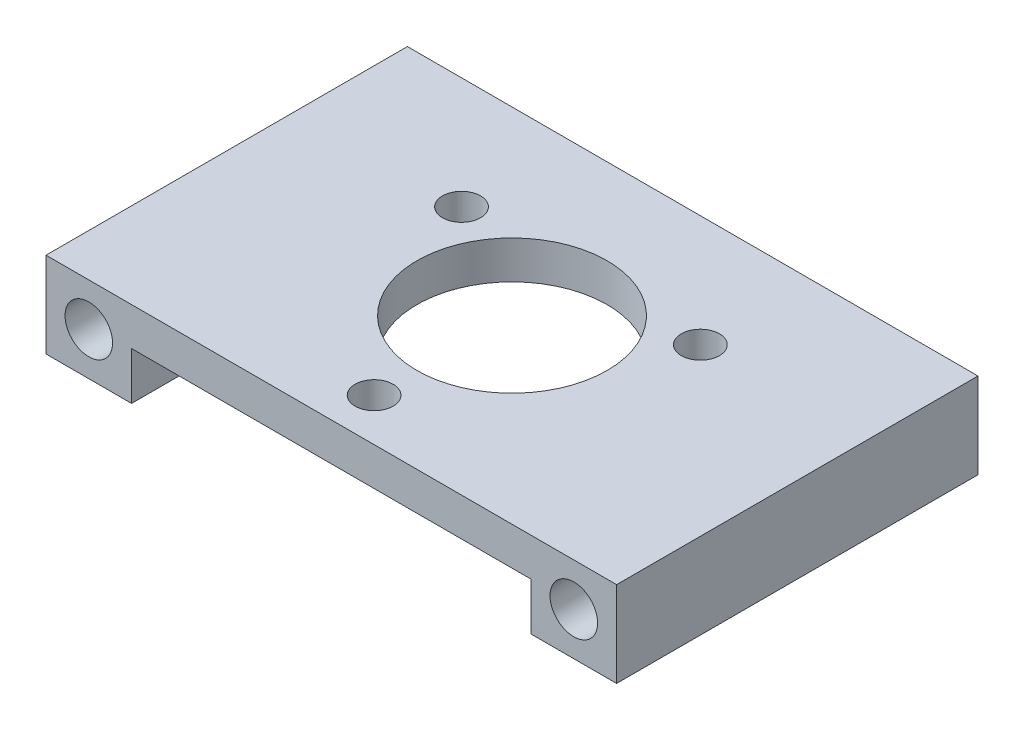
ISO-10303-21;
HEADER;
FILE_DESCRIPTION(('STEP AP214'),'2;1');
FILE_NAME('part.step','',(''),(''),'','','');
FILE_SCHEMA(('AUTOMOTIVE_DESIGN { 1 0 10303 214 1 1 1 1 }'));
ENDSEC;
DATA;
#1=APPLICATION_CONTEXT('core data for automotive mechanical design processes');
#2=APPLICATION_PROTOCOL_DEFINITION('international standard','automotive_design',2000,#1);
#3=PRODUCT_CONTEXT('',#1,'mechanical');
#4=PRODUCT('Part','Part','',(#3));
#5=PRODUCT_RELATED_PRODUCT_CATEGORY('part','',(#4));
#6=PRODUCT_DEFINITION_FORMATION('','',#4);
#7=PRODUCT_DEFINITION_CONTEXT('part definition',#1,'design');
#8=PRODUCT_DEFINITION('design','',#6,#7);
#9=PRODUCT_DEFINITION_SHAPE('','',#8);
#10=(LENGTH_UNIT() NAMED_UNIT(*) SI_UNIT(.MILLI.,.METRE.));
#11=(NAMED_UNIT(*) PLANE_ANGLE_UNIT() SI_UNIT($,.RADIAN.));
#12=(NAMED_UNIT(*) SI_UNIT($,.STERADIAN.) SOLID_ANGLE_UNIT());
#13=UNCERTAINTY_MEASURE_WITH_UNIT(LENGTH_MEASURE(1.E-05),#10,'distance_accuracy_value','');
#14=(GEOMETRIC_REPRESENTATION_CONTEXT(3) GLOBAL_UNCERTAINTY_ASSIGNED_CONTEXT((#13)) GLOBAL_UNIT_ASSIGNED_CONTEXT((#10,
#11,#12)) REPRESENTATION_CONTEXT('',''));
#15=CARTESIAN_POINT('',(0.,0.,0.));
#16=DIRECTION('',(0.,0.,1.));
#17=DIRECTION('',(1.,0.,0.));
#18=AXIS2_PLACEMENT_3D('',#15,#16,#17);
#19=CARTESIAN_POINT('',(0.,0.,38.));
#20=DIRECTION('',(0.,0.,-1.));
#21=DIRECTION('',(-1.,0.,0.));
#22=AXIS2_PLACEMENT_3D('',#19,#20,#21);
#23=PLANE('',#22);
#24=DIRECTION('',(-1.,0.,0.));
#25=VECTOR('',#24,1.);
#26=CARTESIAN_POINT('',(-30.,0.,38.));
#27=LINE('',#26,#25);
#28=CARTESIAN_POINT('',(30.,0.,38.));
#29=VERTEX_POINT('',#28);
#30=CARTESIAN_POINT('',(-30.,0.,38.));
#31=VERTEX_POINT('',#30);
#32=EDGE_CURVE('E144',#29,#31,#27,.T.);
#33=ORIENTED_EDGE('',*,*,#32,.T.);
#34=DIRECTION('',(0.,-1.,0.));
#35=VECTOR('',#34,1.);
#36=CARTESIAN_POINT('',(-30.,0.,38.));
#37=LINE('',#36,#35);
#38=CARTESIAN_POINT('',(-30.,-9.00000000000001,38.));
#39=VERTEX_POINT('',#38);
#40=EDGE_CURVE('E92',#31,#39,#37,.T.);
#41=ORIENTED_EDGE('',*,*,#40,.T.);
#42=DIRECTION('',(1.,0.,0.));
#43=VECTOR('',#42,1.);
#44=CARTESIAN_POINT('',(-30.,-9.00000000000001,38.));
#45=LINE('',#44,#43);
#46=CARTESIAN_POINT('',(-21.,-9.00000000000001,38.));
#47=VERTEX_POINT('',#46);
#48=EDGE_CURVE('E159',#39,#47,#45,.T.);
#49=ORIENTED_EDGE('',*,*,#48,.T.);
#50=DIRECTION('',(0.,1.,0.));
#51=VECTOR('',#50,1.);
#52=CARTESIAN_POINT('',(-21.,-9.00000000000001,38.));
#53=LINE('',#52,#51);
#54=CARTESIAN_POINT('',(-21.,-4.,38.));
#55=VERTEX_POINT('',#54);
#56=EDGE_CURVE('E172',#47,#55,#53,.T.);
#57=ORIENTED_EDGE('',*,*,#56,.T.);
#58=DIRECTION('',(1.,0.,0.));
#59=VECTOR('',#58,1.);
#60=CARTESIAN_POINT('',(-21.,-4.,38.));
#61=LINE('',#60,#59);
#62=CARTESIAN_POINT('',(21.,-4.,38.));
#63=VERTEX_POINT('',#62);
#64=EDGE_CURVE('E111',#55,#63,#61,.T.);
#65=ORIENTED_EDGE('',*,*,#64,.T.);
#66=DIRECTION('',(0.,-1.,0.));
#67=VECTOR('',#66,1.);
#68=CARTESIAN_POINT('',(21.,-9.,38.));
#69=LINE('',#68,#67);
#70=CARTESIAN_POINT('',(21.,-9.,38.));
#71=VERTEX_POINT('',#70);
#72=EDGE_CURVE('E105',#63,#71,#69,.T.);
#73=ORIENTED_EDGE('',*,*,#72,.T.);
#74=DIRECTION('',(1.,0.,0.));
#75=VECTOR('',#74,1.);
#76=CARTESIAN_POINT('',(30.,-9.,38.));
#77=LINE('',#76,#75);
#78=CARTESIAN_POINT('',(30.,-9.,38.));
#79=VERTEX_POINT('',#78);
#80=EDGE_CURVE('E109',#71,#79,#77,.T.);
#81=ORIENTED_EDGE('',*,*,#80,.T.);
#82=DIRECTION('',(0.,1.,0.));
#83=VECTOR('',#82,1.);
#84=CARTESIAN_POINT('',(30.,0.,38.));
#85=LINE('',#84,#83);
#86=EDGE_CURVE('E49',#79,#29,#85,.T.);
#87=ORIENTED_EDGE('',*,*,#86,.T.);
#88=EDGE_LOOP('',(#33,#41,#49,#57,#65,#73,#81,#87));
#89=FACE_BOUND('',#88,.T.);
#90=CARTESIAN_POINT('',(25.5,-4.5,38.));
#91=DIRECTION('',(0.,0.,1.));
#92=DIRECTION('',(-1.,0.,0.));
#93=AXIS2_PLACEMENT_3D('',#90,#91,#92);
#94=CIRCLE('',#93,2.5);
#95=CARTESIAN_POINT('',(23.,-4.5,38.));
#96=VERTEX_POINT('',#95);
#97=EDGE_CURVE('E133',#96,#96,#94,.T.);
#98=ORIENTED_EDGE('',*,*,#97,.F.);
#99=EDGE_LOOP('',(#98));
#100=FACE_BOUND('',#99,.T.);
#101=CARTESIAN_POINT('',(-25.5,-4.5,38.));
#102=DIRECTION('',(0.,0.,1.));
#103=DIRECTION('',(1.,0.,0.));
#104=AXIS2_PLACEMENT_3D('',#101,#102,#103);
#105=CIRCLE('',#104,2.5);
#106=CARTESIAN_POINT('',(-23.,-4.5,38.));
#107=VERTEX_POINT('',#106);
#108=EDGE_CURVE('E181',#107,#107,#105,.T.);
#109=ORIENTED_EDGE('',*,*,#108,.F.);
#110=EDGE_LOOP('',(#109));
#111=FACE_BOUND('',#110,.T.);
#112=ADVANCED_FACE('F32',(#89,#100,#111),#23,.F.);
#113=CARTESIAN_POINT('',(0.,0.,0.));
#114=DIRECTION('',(0.,0.,-1.));
#115=DIRECTION('',(-1.,0.,0.));
#116=AXIS2_PLACEMENT_3D('',#113,#114,#115);
#117=PLANE('',#116);
#118=CARTESIAN_POINT('',(25.5,-4.5,0.));
#119=DIRECTION('',(0.,0.,1.));
#120=DIRECTION('',(-1.,0.,0.));
#121=AXIS2_PLACEMENT_3D('',#118,#119,#120);
#122=CIRCLE('',#121,2.5);
#123=CARTESIAN_POINT('',(23.,-4.5,0.));
#124=VERTEX_POINT('',#123);
#125=EDGE_CURVE('E178',#124,#124,#122,.T.);
#126=ORIENTED_EDGE('',*,*,#125,.T.);
#127=EDGE_LOOP('',(#126));
#128=FACE_BOUND('',#127,.T.);
#129=DIRECTION('',(-1.,0.,0.));
#130=VECTOR('',#129,1.);
#131=CARTESIAN_POINT('',(-30.,0.,0.));
#132=LINE('',#131,#130);
#133=CARTESIAN_POINT('',(30.,0.,0.));
#134=VERTEX_POINT('',#133);
#135=CARTESIAN_POINT('',(-30.,0.,0.));
#136=VERTEX_POINT('',#135);
#137=EDGE_CURVE('E129',#134,#136,#132,.T.);
#138=ORIENTED_EDGE('',*,*,#137,.F.);
#139=DIRECTION('',(0.,1.,0.));
#140=VECTOR('',#139,1.);
#141=CARTESIAN_POINT('',(30.,0.,0.));
#142=LINE('',#141,#140);
#143=CARTESIAN_POINT('',(30.,-9.,0.));
#144=VERTEX_POINT('',#143);
#145=EDGE_CURVE('E84',#144,#134,#142,.T.);
#146=ORIENTED_EDGE('',*,*,#145,.F.);
#147=DIRECTION('',(1.,0.,0.));
#148=VECTOR('',#147,1.);
#149=CARTESIAN_POINT('',(30.,-9.,0.));
#150=LINE('',#149,#148);
#151=CARTESIAN_POINT('',(21.,-9.,0.));
#152=VERTEX_POINT('',#151);
#153=EDGE_CURVE('E78',#152,#144,#150,.T.);
#154=ORIENTED_EDGE('',*,*,#153,.F.);
#155=DIRECTION('',(0.,-1.,0.));
#156=VECTOR('',#155,1.);
#157=CARTESIAN_POINT('',(21.,-9.,0.));
#158=LINE('',#157,#156);
#159=CARTESIAN_POINT('',(21.,-4.,0.));
#160=VERTEX_POINT('',#159);
#161=EDGE_CURVE('E119',#160,#152,#158,.T.);
#162=ORIENTED_EDGE('',*,*,#161,.F.);
#163=DIRECTION('',(1.,0.,0.));
#164=VECTOR('',#163,1.);
#165=CARTESIAN_POINT('',(-21.,-4.,0.));
#166=LINE('',#165,#164);
#167=CARTESIAN_POINT('',(-21.,-4.,0.));
#168=VERTEX_POINT('',#167);
#169=EDGE_CURVE('E139',#168,#160,#166,.T.);
#170=ORIENTED_EDGE('',*,*,#169,.F.);
#171=DIRECTION('',(0.,1.,0.));
#172=VECTOR('',#171,1.);
#173=CARTESIAN_POINT('',(-21.,-9.00000000000001,0.));
#174=LINE('',#173,#172);
#175=CARTESIAN_POINT('',(-21.,-9.00000000000001,0.));
#176=VERTEX_POINT('',#175);
#177=EDGE_CURVE('E137',#176,#168,#174,.T.);
#178=ORIENTED_EDGE('',*,*,#177,.F.);
#179=DIRECTION('',(1.,0.,0.));
#180=VECTOR('',#179,1.);
#181=CARTESIAN_POINT('',(-30.,-9.00000000000001,0.));
#182=LINE('',#181,#180);
#183=CARTESIAN_POINT('',(-30.,-9.00000000000001,0.));
#184=VERTEX_POINT('',#183);
#185=EDGE_CURVE('E135',#184,#176,#182,.T.);
#186=ORIENTED_EDGE('',*,*,#185,.F.);
#187=DIRECTION('',(0.,-1.,0.));
#188=VECTOR('',#187,1.);
#189=CARTESIAN_POINT('',(-30.,0.,0.));
#190=LINE('',#189,#188);
#191=EDGE_CURVE('E132',#136,#184,#190,.T.);
#192=ORIENTED_EDGE('',*,*,#191,.F.);
#193=EDGE_LOOP('',(#138,#146,#154,#162,#170,#178,#186,#192));
#194=FACE_BOUND('',#193,.T.);
#195=CARTESIAN_POINT('',(-25.5,-4.5,0.));
#196=DIRECTION('',(0.,0.,1.));
#197=DIRECTION('',(1.,0.,0.));
#198=AXIS2_PLACEMENT_3D('',#195,#196,#197);
#199=CIRCLE('',#198,2.5);
#200=CARTESIAN_POINT('',(-23.,-4.5,0.));
#201=VERTEX_POINT('',#200);
#202=EDGE_CURVE('E184',#201,#201,#199,.T.);
#203=ORIENTED_EDGE('',*,*,#202,.T.);
#204=EDGE_LOOP('',(#203));
#205=FACE_BOUND('',#204,.T.);
#206=ADVANCED_FACE('F163',(#128,#194,#205),#117,.T.);
#207=CARTESIAN_POINT('',(-30.,0.,38.));
#208=DIRECTION('',(0.,-1.,0.));
#209=DIRECTION('',(1.,0.,0.));
#210=AXIS2_PLACEMENT_3D('',#207,#208,#209);
#211=PLANE('',#210);
#212=CARTESIAN_POINT('',(-12.5573683548735,0.,11.7499999999996));
#213=DIRECTION('',(0.,-1.,0.));
#214=DIRECTION('',(1.,0.,0.));
#215=AXIS2_PLACEMENT_3D('',#212,#213,#214);
#216=CIRCLE('',#215,2.);
#217=CARTESIAN_POINT('',(-10.5573683548735,0.,11.7499999999996));
#218=VERTEX_POINT('',#217);
#219=EDGE_CURVE('E187',#218,#218,#216,.T.);
#220=ORIENTED_EDGE('',*,*,#219,.T.);
#221=EDGE_LOOP('',(#220));
#222=FACE_BOUND('',#221,.T.);
#223=CARTESIAN_POINT('',(12.5573683548752,0.,11.7500000000005));
#224=DIRECTION('',(0.,-1.,0.));
#225=DIRECTION('',(1.,0.,0.));
#226=AXIS2_PLACEMENT_3D('',#223,#224,#225);
#227=CIRCLE('',#226,2.);
#228=CARTESIAN_POINT('',(14.5573683548752,0.,11.7500000000005));
#229=VERTEX_POINT('',#228);
#230=EDGE_CURVE('E192',#229,#229,#227,.T.);
#231=ORIENTED_EDGE('',*,*,#230,.T.);
#232=EDGE_LOOP('',(#231));
#233=FACE_BOUND('',#232,.T.);
#234=CARTESIAN_POINT('',(0.,0.,33.5));
#235=DIRECTION('',(0.,-1.,0.));
#236=DIRECTION('',(1.,0.,0.));
#237=AXIS2_PLACEMENT_3D('',#234,#235,#236);
#238=CIRCLE('',#237,2.);
#239=CARTESIAN_POINT('',(2.,0.,33.5));
#240=VERTEX_POINT('',#239);
#241=EDGE_CURVE('E195',#240,#240,#238,.T.);
#242=ORIENTED_EDGE('',*,*,#241,.T.);
#243=EDGE_LOOP('',(#242));
#244=FACE_BOUND('',#243,.T.);
#245=CARTESIAN_POINT('',(0.,0.,19.));
#246=DIRECTION('',(0.,-1.,0.));
#247=DIRECTION('',(1.,0.,0.));
#248=AXIS2_PLACEMENT_3D('',#245,#246,#247);
#249=CIRCLE('',#248,10.);
#250=CARTESIAN_POINT('',(10.,0.,19.));
#251=VERTEX_POINT('',#250);
#252=EDGE_CURVE('E198',#251,#251,#249,.T.);
#253=ORIENTED_EDGE('',*,*,#252,.T.);
#254=EDGE_LOOP('',(#253));
#255=FACE_BOUND('',#254,.T.);
#256=ORIENTED_EDGE('',*,*,#137,.T.);
#257=DIRECTION('',(0.,0.,-1.));
#258=VECTOR('',#257,1.);
#259=CARTESIAN_POINT('',(-30.,0.,38.));
#260=LINE('',#259,#258);
#261=EDGE_CURVE('E11',#31,#136,#260,.T.);
#262=ORIENTED_EDGE('',*,*,#261,.F.);
#263=ORIENTED_EDGE('',*,*,#32,.F.);
#264=DIRECTION('',(0.,0.,-1.));
#265=VECTOR('',#264,1.);
#266=CARTESIAN_POINT('',(30.,0.,38.));
#267=LINE('',#266,#265);
#268=EDGE_CURVE('E125',#29,#134,#267,.T.);
#269=ORIENTED_EDGE('',*,*,#268,.T.);
#270=EDGE_LOOP('',(#256,#262,#263,#269));
#271=FACE_BOUND('',#270,.T.);
#272=ADVANCED_FACE('F34',(#222,#233,#244,#255,#271),#211,.F.);
#273=CARTESIAN_POINT('',(-30.,0.,38.));
#274=DIRECTION('',(1.,0.,0.));
#275=DIRECTION('',(0.,0.,-1.));
#276=AXIS2_PLACEMENT_3D('',#273,#274,#275);
#277=PLANE('',#276);
#278=ORIENTED_EDGE('',*,*,#191,.T.);
#279=DIRECTION('',(0.,0.,-1.));
#280=VECTOR('',#279,1.);
#281=CARTESIAN_POINT('',(-30.,-9.00000000000001,38.));
#282=LINE('',#281,#280);
#283=EDGE_CURVE('E41',#39,#184,#282,.T.);
#284=ORIENTED_EDGE('',*,*,#283,.F.);
#285=ORIENTED_EDGE('',*,*,#40,.F.);
#286=ORIENTED_EDGE('',*,*,#261,.T.);
#287=EDGE_LOOP('',(#278,#284,#285,#286));
#288=FACE_BOUND('',#287,.T.);
#289=ADVANCED_FACE('F232',(#288),#277,.F.);
#290=CARTESIAN_POINT('',(-30.,-9.00000000000001,38.));
#291=DIRECTION('',(0.,1.,0.));
#292=DIRECTION('',(0.,0.,1.));
#293=AXIS2_PLACEMENT_3D('',#290,#291,#292);
#294=PLANE('',#293);
#295=ORIENTED_EDGE('',*,*,#185,.T.);
#296=DIRECTION('',(0.,0.,-1.));
#297=VECTOR('',#296,1.);
#298=CARTESIAN_POINT('',(-21.,-9.00000000000001,38.));
#299=LINE('',#298,#297);
#300=EDGE_CURVE('E151',#47,#176,#299,.T.);
#301=ORIENTED_EDGE('',*,*,#300,.F.);
#302=ORIENTED_EDGE('',*,*,#48,.F.);
#303=ORIENTED_EDGE('',*,*,#283,.T.);
#304=EDGE_LOOP('',(#295,#301,#302,#303));
#305=FACE_BOUND('',#304,.T.);
#306=ADVANCED_FACE('F157',(#305),#294,.F.);
#307=CARTESIAN_POINT('',(-21.,-9.00000000000001,38.));
#308=DIRECTION('',(-1.,0.,0.));
#309=DIRECTION('',(0.,0.,1.));
#310=AXIS2_PLACEMENT_3D('',#307,#308,#309);
#311=PLANE('',#310);
#312=ORIENTED_EDGE('',*,*,#177,.T.);
#313=DIRECTION('',(0.,0.,-1.));
#314=VECTOR('',#313,1.);
#315=CARTESIAN_POINT('',(-21.,-4.,38.));
#316=LINE('',#315,#314);
#317=EDGE_CURVE('E148',#55,#168,#316,.T.);
#318=ORIENTED_EDGE('',*,*,#317,.F.);
#319=ORIENTED_EDGE('',*,*,#56,.F.);
#320=ORIENTED_EDGE('',*,*,#300,.T.);
#321=EDGE_LOOP('',(#312,#318,#319,#320));
#322=FACE_BOUND('',#321,.T.);
#323=ADVANCED_FACE('F168',(#322),#311,.F.);
#324=CARTESIAN_POINT('',(-21.,-4.,38.));
#325=DIRECTION('',(0.,1.,0.));
#326=DIRECTION('',(0.,0.,1.));
#327=AXIS2_PLACEMENT_3D('',#324,#325,#326);
#328=PLANE('',#327);
#329=CARTESIAN_POINT('',(-12.5573683548735,-4.,11.7499999999996));
#330=DIRECTION('',(0.,-1.,0.));
#331=DIRECTION('',(1.,0.,0.));
#332=AXIS2_PLACEMENT_3D('',#329,#330,#331);
#333=CIRCLE('',#332,2.);
#334=CARTESIAN_POINT('',(-10.5573683548735,-4.,11.7499999999996));
#335=VERTEX_POINT('',#334);
#336=EDGE_CURVE('E205',#335,#335,#333,.T.);
#337=ORIENTED_EDGE('',*,*,#336,.F.);
#338=EDGE_LOOP('',(#337));
#339=FACE_BOUND('',#338,.T.);
#340=CARTESIAN_POINT('',(12.5573683548752,-4.,11.7500000000005));
#341=DIRECTION('',(0.,-1.,0.));
#342=DIRECTION('',(1.,0.,0.));
#343=AXIS2_PLACEMENT_3D('',#340,#341,#342);
#344=CIRCLE('',#343,2.);
#345=CARTESIAN_POINT('',(14.5573683548752,-4.,11.7500000000005));
#346=VERTEX_POINT('',#345);
#347=EDGE_CURVE('E208',#346,#346,#344,.T.);
#348=ORIENTED_EDGE('',*,*,#347,.F.);
#349=EDGE_LOOP('',(#348));
#350=FACE_BOUND('',#349,.T.);
#351=CARTESIAN_POINT('',(0.,-4.,33.5));
#352=DIRECTION('',(0.,-1.,0.));
#353=DIRECTION('',(1.,0.,0.));
#354=AXIS2_PLACEMENT_3D('',#351,#352,#353);
#355=CIRCLE('',#354,2.);
#356=CARTESIAN_POINT('',(2.,-4.,33.5));
#357=VERTEX_POINT('',#356);
#358=EDGE_CURVE('E204',#357,#357,#355,.T.);
#359=ORIENTED_EDGE('',*,*,#358,.F.);
#360=EDGE_LOOP('',(#359));
#361=FACE_BOUND('',#360,.T.);
#362=CARTESIAN_POINT('',(0.,-4.,19.));
#363=DIRECTION('',(0.,-1.,0.));
#364=DIRECTION('',(1.,0.,0.));
#365=AXIS2_PLACEMENT_3D('',#362,#363,#364);
#366=CIRCLE('',#365,10.);
#367=CARTESIAN_POINT('',(10.,-4.,19.));
#368=VERTEX_POINT('',#367);
#369=EDGE_CURVE('E201',#368,#368,#366,.T.);
#370=ORIENTED_EDGE('',*,*,#369,.F.);
#371=EDGE_LOOP('',(#370));
#372=FACE_BOUND('',#371,.T.);
#373=ORIENTED_EDGE('',*,*,#169,.T.);
#374=DIRECTION('',(0.,0.,-1.));
#375=VECTOR('',#374,1.);
#376=CARTESIAN_POINT('',(21.,-4.,38.));
#377=LINE('',#376,#375);
#378=EDGE_CURVE('E120',#63,#160,#377,.T.);
#379=ORIENTED_EDGE('',*,*,#378,.F.);
#380=ORIENTED_EDGE('',*,*,#64,.F.);
#381=ORIENTED_EDGE('',*,*,#317,.T.);
#382=EDGE_LOOP('',(#373,#379,#380,#381));
#383=FACE_BOUND('',#382,.T.);
#384=ADVANCED_FACE('F171',(#339,#350,#361,#372,#383),#328,.F.);
#385=CARTESIAN_POINT('',(21.,-9.,38.));
#386=DIRECTION('',(1.,0.,0.));
#387=DIRECTION('',(0.,1.,0.));
#388=AXIS2_PLACEMENT_3D('',#385,#386,#387);
#389=PLANE('',#388);
#390=ORIENTED_EDGE('',*,*,#161,.T.);
#391=DIRECTION('',(0.,0.,-1.));
#392=VECTOR('',#391,1.);
#393=CARTESIAN_POINT('',(21.,-9.,38.));
#394=LINE('',#393,#392);
#395=EDGE_CURVE('E116',#71,#152,#394,.T.);
#396=ORIENTED_EDGE('',*,*,#395,.F.);
#397=ORIENTED_EDGE('',*,*,#72,.F.);
#398=ORIENTED_EDGE('',*,*,#378,.T.);
#399=EDGE_LOOP('',(#390,#396,#397,#398));
#400=FACE_BOUND('',#399,.T.);
#401=ADVANCED_FACE('F117',(#400),#389,.F.);
#402=CARTESIAN_POINT('',(30.,-9.,38.));
#403=DIRECTION('',(0.,1.,0.));
#404=DIRECTION('',(0.,0.,1.));
#405=AXIS2_PLACEMENT_3D('',#402,#403,#404);
#406=PLANE('',#405);
#407=ORIENTED_EDGE('',*,*,#153,.T.);
#408=DIRECTION('',(0.,0.,-1.));
#409=VECTOR('',#408,1.);
#410=CARTESIAN_POINT('',(30.,-9.,38.));
#411=LINE('',#410,#409);
#412=EDGE_CURVE('E121',#79,#144,#411,.T.);
#413=ORIENTED_EDGE('',*,*,#412,.F.);
#414=ORIENTED_EDGE('',*,*,#80,.F.);
#415=ORIENTED_EDGE('',*,*,#395,.T.);
#416=EDGE_LOOP('',(#407,#413,#414,#415));
#417=FACE_BOUND('',#416,.T.);
#418=ADVANCED_FACE('F123',(#417),#406,.F.);
#419=CARTESIAN_POINT('',(30.,0.,38.));
#420=DIRECTION('',(-1.,0.,0.));
#421=DIRECTION('',(0.,0.,1.));
#422=AXIS2_PLACEMENT_3D('',#419,#420,#421);
#423=PLANE('',#422);
#424=ORIENTED_EDGE('',*,*,#145,.T.);
#425=ORIENTED_EDGE('',*,*,#268,.F.);
#426=ORIENTED_EDGE('',*,*,#86,.F.);
#427=ORIENTED_EDGE('',*,*,#412,.T.);
#428=EDGE_LOOP('',(#424,#425,#426,#427));
#429=FACE_BOUND('',#428,.T.);
#430=ADVANCED_FACE('F236',(#429),#423,.F.);
#431=CARTESIAN_POINT('',(25.5,-4.5,38.));
#432=DIRECTION('',(0.,0.,-1.));
#433=DIRECTION('',(-1.,0.,0.));
#434=AXIS2_PLACEMENT_3D('',#431,#432,#433);
#435=CYLINDRICAL_SURFACE('',#434,2.5);
#436=ORIENTED_EDGE('',*,*,#97,.T.);
#437=EDGE_LOOP('',(#436));
#438=FACE_BOUND('',#437,.T.);
#439=ORIENTED_EDGE('',*,*,#125,.F.);
#440=EDGE_LOOP('',(#439));
#441=FACE_BOUND('',#440,.T.);
#442=ADVANCED_FACE('F238',(#438,#441),#435,.F.);
#443=CARTESIAN_POINT('',(-25.5,-4.5,38.));
#444=DIRECTION('',(0.,0.,-1.));
#445=DIRECTION('',(-1.,0.,0.));
#446=AXIS2_PLACEMENT_3D('',#443,#444,#445);
#447=CYLINDRICAL_SURFACE('',#446,2.5);
#448=ORIENTED_EDGE('',*,*,#108,.T.);
#449=EDGE_LOOP('',(#448));
#450=FACE_BOUND('',#449,.T.);
#451=ORIENTED_EDGE('',*,*,#202,.F.);
#452=EDGE_LOOP('',(#451));
#453=FACE_BOUND('',#452,.T.);
#454=ADVANCED_FACE('F226',(#450,#453),#447,.F.);
#455=CARTESIAN_POINT('',(0.,34.,19.));
#456=DIRECTION('',(0.,-1.,0.));
#457=DIRECTION('',(1.,0.,0.));
#458=AXIS2_PLACEMENT_3D('',#455,#456,#457);
#459=CYLINDRICAL_SURFACE('',#458,10.);
#460=ORIENTED_EDGE('',*,*,#369,.T.);
#461=EDGE_LOOP('',(#460));
#462=FACE_BOUND('',#461,.T.);
#463=ORIENTED_EDGE('',*,*,#252,.F.);
#464=EDGE_LOOP('',(#463));
#465=FACE_BOUND('',#464,.T.);
#466=ADVANCED_FACE('F223',(#462,#465),#459,.F.);
#467=CARTESIAN_POINT('',(0.,34.,33.5));
#468=DIRECTION('',(0.,-1.,0.));
#469=DIRECTION('',(1.,0.,0.));
#470=AXIS2_PLACEMENT_3D('',#467,#468,#469);
#471=CYLINDRICAL_SURFACE('',#470,2.);
#472=ORIENTED_EDGE('',*,*,#358,.T.);
#473=EDGE_LOOP('',(#472));
#474=FACE_BOUND('',#473,.T.);
#475=ORIENTED_EDGE('',*,*,#241,.F.);
#476=EDGE_LOOP('',(#475));
#477=FACE_BOUND('',#476,.T.);
#478=ADVANCED_FACE('F214',(#474,#477),#471,.F.);
#479=CARTESIAN_POINT('',(12.5573683548753,34.,11.7500000000005));
#480=DIRECTION('',(0.,-1.,0.));
#481=DIRECTION('',(1.,0.,0.));
#482=AXIS2_PLACEMENT_3D('',#479,#480,#481);
#483=CYLINDRICAL_SURFACE('',#482,2.);
#484=ORIENTED_EDGE('',*,*,#347,.T.);
#485=EDGE_LOOP('',(#484));
#486=FACE_BOUND('',#485,.T.);
#487=ORIENTED_EDGE('',*,*,#230,.F.);
#488=EDGE_LOOP('',(#487));
#489=FACE_BOUND('',#488,.T.);
#490=ADVANCED_FACE('F261',(#486,#489),#483,.F.);
#491=CARTESIAN_POINT('',(-12.5573683548735,34.,11.7499999999996));
#492=DIRECTION('',(0.,-1.,0.));
#493=DIRECTION('',(1.,0.,0.));
#494=AXIS2_PLACEMENT_3D('',#491,#492,#493);
#495=CYLINDRICAL_SURFACE('',#494,2.);
#496=ORIENTED_EDGE('',*,*,#336,.T.);
#497=EDGE_LOOP('',(#496));
#498=FACE_BOUND('',#497,.T.);
#499=ORIENTED_EDGE('',*,*,#219,.F.);
#500=EDGE_LOOP('',(#499));
#501=FACE_BOUND('',#500,.T.);
#502=ADVANCED_FACE('F258',(#498,#501),#495,.F.);
#503=CLOSED_SHELL('',(#112,#206,#272,#289,#306,#323,#384,#401,#418,#430,#442,#454,#466,#478,
#490,#502));
#504=MANIFOLD_SOLID_BREP('B2',#503);
#505=ADVANCED_BREP_SHAPE_REPRESENTATION('',(#18,#504),#14);
#506=SHAPE_DEFINITION_REPRESENTATION(#9,#505);
ENDSEC;
END-ISO-10303-21;
